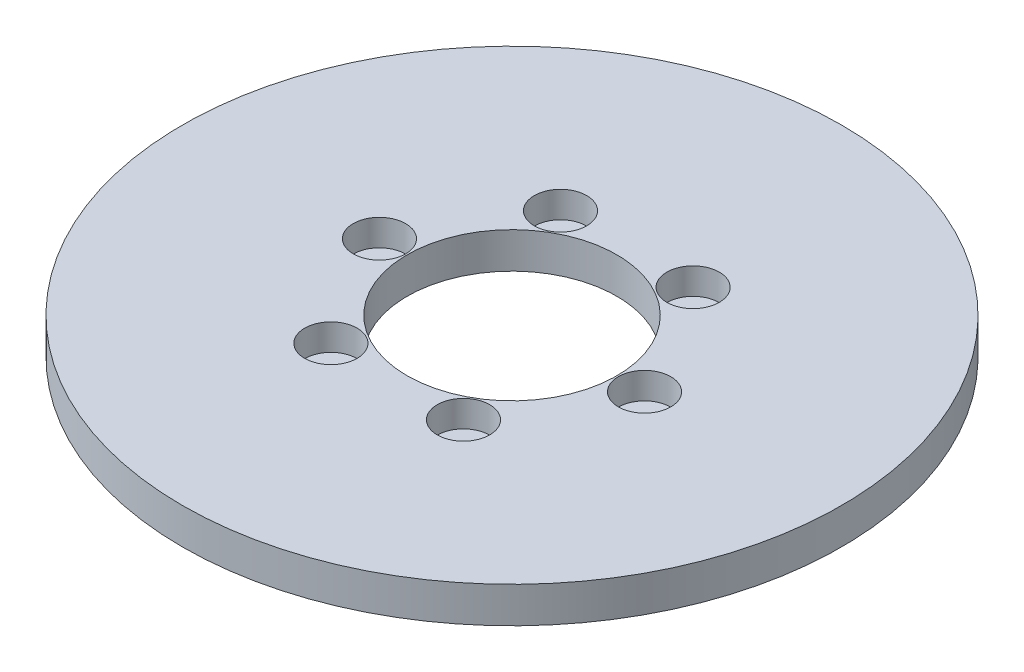
ISO-10303-21;
HEADER;
FILE_DESCRIPTION(('STEP AP214'),'2;1');
FILE_NAME('part.step','',(''),(''),'','','');
FILE_SCHEMA(('AUTOMOTIVE_DESIGN { 1 0 10303 214 1 1 1 1 }'));
ENDSEC;
DATA;
#1=APPLICATION_CONTEXT('core data for automotive mechanical design processes');
#2=APPLICATION_PROTOCOL_DEFINITION('international standard','automotive_design',2000,#1);
#3=PRODUCT_CONTEXT('',#1,'mechanical');
#4=PRODUCT('Part','Part','',(#3));
#5=PRODUCT_RELATED_PRODUCT_CATEGORY('part','',(#4));
#6=PRODUCT_DEFINITION_FORMATION('','',#4);
#7=PRODUCT_DEFINITION_CONTEXT('part definition',#1,'design');
#8=PRODUCT_DEFINITION('design','',#6,#7);
#9=PRODUCT_DEFINITION_SHAPE('','',#8);
#10=(LENGTH_UNIT() NAMED_UNIT(*) SI_UNIT(.MILLI.,.METRE.));
#11=(NAMED_UNIT(*) PLANE_ANGLE_UNIT() SI_UNIT($,.RADIAN.));
#12=(NAMED_UNIT(*) SI_UNIT($,.STERADIAN.) SOLID_ANGLE_UNIT());
#13=UNCERTAINTY_MEASURE_WITH_UNIT(LENGTH_MEASURE(1.E-05),#10,'distance_accuracy_value','');
#14=(GEOMETRIC_REPRESENTATION_CONTEXT(3) GLOBAL_UNCERTAINTY_ASSIGNED_CONTEXT((#13)) GLOBAL_UNIT_ASSIGNED_CONTEXT((#10,
#11,#12)) REPRESENTATION_CONTEXT('',''));
#15=CARTESIAN_POINT('',(0.,0.,0.));
#16=DIRECTION('',(0.,0.,1.));
#17=DIRECTION('',(1.,0.,0.));
#18=AXIS2_PLACEMENT_3D('',#15,#16,#17);
#19=CARTESIAN_POINT('',(0.,6.,0.));
#20=DIRECTION('',(0.,-1.,0.));
#21=DIRECTION('',(0.,0.,-1.));
#22=AXIS2_PLACEMENT_3D('',#19,#20,#21);
#23=CYLINDRICAL_SURFACE('',#22,55.);
#24=CARTESIAN_POINT('',(0.,6.,0.));
#25=DIRECTION('',(0.,1.,0.));
#26=DIRECTION('',(0.,0.,1.));
#27=AXIS2_PLACEMENT_3D('',#24,#25,#26);
#28=CIRCLE('',#27,55.);
#29=CARTESIAN_POINT('',(0.,6.,55.));
#30=VERTEX_POINT('',#29);
#31=EDGE_CURVE('E10',#30,#30,#28,.T.);
#32=ORIENTED_EDGE('',*,*,#31,.F.);
#33=EDGE_LOOP('',(#32));
#34=FACE_BOUND('',#33,.T.);
#35=CARTESIAN_POINT('',(0.,0.,0.));
#36=DIRECTION('',(0.,1.,0.));
#37=DIRECTION('',(0.,0.,1.));
#38=AXIS2_PLACEMENT_3D('',#35,#36,#37);
#39=CIRCLE('',#38,55.);
#40=CARTESIAN_POINT('',(0.,0.,55.));
#41=VERTEX_POINT('',#40);
#42=EDGE_CURVE('E37',#41,#41,#39,.T.);
#43=ORIENTED_EDGE('',*,*,#42,.T.);
#44=EDGE_LOOP('',(#43));
#45=FACE_BOUND('',#44,.T.);
#46=ADVANCED_FACE('F40',(#34,#45),#23,.T.);
#47=CARTESIAN_POINT('',(0.,6.,0.));
#48=DIRECTION('',(0.,1.,0.));
#49=DIRECTION('',(0.,0.,1.));
#50=AXIS2_PLACEMENT_3D('',#47,#48,#49);
#51=PLANE('',#50);
#52=CARTESIAN_POINT('',(-11.0613963231779,6.,-19.1589004343992));
#53=DIRECTION('',(0.,1.,0.));
#54=DIRECTION('',(-0.866025403784433,0.,0.50000000000001));
#55=AXIS2_PLACEMENT_3D('',#52,#53,#54);
#56=CIRCLE('',#55,4.37630442030484);
#57=CARTESIAN_POINT('',(-14.851387125856,6.,-16.9707482242467));
#58=VERTEX_POINT('',#57);
#59=EDGE_CURVE('E70',#58,#58,#56,.T.);
#60=ORIENTED_EDGE('',*,*,#59,.F.);
#61=EDGE_LOOP('',(#60));
#62=FACE_BOUND('',#61,.T.);
#63=CARTESIAN_POINT('',(11.0613963231775,6.,-19.1589004343994));
#64=DIRECTION('',(0.,1.,0.));
#65=DIRECTION('',(-0.866025403784443,0.,-0.499999999999992));
#66=AXIS2_PLACEMENT_3D('',#63,#64,#65);
#67=CIRCLE('',#66,4.37630442030484);
#68=CARTESIAN_POINT('',(7.27140552049935,6.,-21.3470526445518));
#69=VERTEX_POINT('',#68);
#70=EDGE_CURVE('E71',#69,#69,#67,.T.);
#71=ORIENTED_EDGE('',*,*,#70,.F.);
#72=EDGE_LOOP('',(#71));
#73=FACE_BOUND('',#72,.T.);
#74=CARTESIAN_POINT('',(22.1227926463553,6.,0.));
#75=DIRECTION('',(0.,1.,0.));
#76=DIRECTION('',(0.,0.,-1.));
#77=AXIS2_PLACEMENT_3D('',#74,#75,#76);
#78=CIRCLE('',#77,4.37630442030484);
#79=CARTESIAN_POINT('',(22.1227926463553,6.,-4.37630442030484));
#80=VERTEX_POINT('',#79);
#81=EDGE_CURVE('E78',#80,#80,#78,.T.);
#82=ORIENTED_EDGE('',*,*,#81,.F.);
#83=EDGE_LOOP('',(#82));
#84=FACE_BOUND('',#83,.T.);
#85=CARTESIAN_POINT('',(11.0613963231778,6.,19.1589004343992));
#86=DIRECTION('',(0.,1.,0.));
#87=DIRECTION('',(0.866025403784436,0.,-0.500000000000004));
#88=AXIS2_PLACEMENT_3D('',#85,#86,#87);
#89=CIRCLE('',#88,4.37630442030484);
#90=CARTESIAN_POINT('',(14.8513871258559,6.,16.9707482242468));
#91=VERTEX_POINT('',#90);
#92=EDGE_CURVE('E84',#91,#91,#89,.T.);
#93=ORIENTED_EDGE('',*,*,#92,.F.);
#94=EDGE_LOOP('',(#93));
#95=FACE_BOUND('',#94,.T.);
#96=CARTESIAN_POINT('',(-11.0613963231776,6.,19.1589004343993));
#97=DIRECTION('',(0.,1.,0.));
#98=DIRECTION('',(0.86602540378444,0.,0.499999999999998));
#99=AXIS2_PLACEMENT_3D('',#96,#97,#98);
#100=CIRCLE('',#99,4.37630442030484);
#101=CARTESIAN_POINT('',(-7.2714055204995,6.,21.3470526445517));
#102=VERTEX_POINT('',#101);
#103=EDGE_CURVE('E61',#102,#102,#100,.T.);
#104=ORIENTED_EDGE('',*,*,#103,.F.);
#105=EDGE_LOOP('',(#104));
#106=FACE_BOUND('',#105,.T.);
#107=CARTESIAN_POINT('',(-22.1227926463553,6.,0.));
#108=DIRECTION('',(0.,1.,0.));
#109=DIRECTION('',(0.,0.,1.));
#110=AXIS2_PLACEMENT_3D('',#107,#108,#109);
#111=CIRCLE('',#110,4.37630442030484);
#112=CARTESIAN_POINT('',(-22.1227926463553,6.,4.37630442030484));
#113=VERTEX_POINT('',#112);
#114=EDGE_CURVE('E54',#113,#113,#111,.T.);
#115=ORIENTED_EDGE('',*,*,#114,.F.);
#116=EDGE_LOOP('',(#115));
#117=FACE_BOUND('',#116,.T.);
#118=CARTESIAN_POINT('',(0.,6.,0.));
#119=DIRECTION('',(0.,1.,0.));
#120=DIRECTION('',(0.,0.,1.));
#121=AXIS2_PLACEMENT_3D('',#118,#119,#120);
#122=CIRCLE('',#121,17.5);
#123=CARTESIAN_POINT('',(0.,6.,17.5));
#124=VERTEX_POINT('',#123);
#125=EDGE_CURVE('E50',#124,#124,#122,.T.);
#126=ORIENTED_EDGE('',*,*,#125,.F.);
#127=EDGE_LOOP('',(#126));
#128=FACE_BOUND('',#127,.T.);
#129=ORIENTED_EDGE('',*,*,#31,.T.);
#130=EDGE_LOOP('',(#129));
#131=FACE_BOUND('',#130,.T.);
#132=ADVANCED_FACE('F99',(#62,#73,#84,#95,#106,#117,#128,#131),#51,.T.);
#133=CARTESIAN_POINT('',(0.,0.,0.));
#134=DIRECTION('',(0.,1.,0.));
#135=DIRECTION('',(0.,0.,1.));
#136=AXIS2_PLACEMENT_3D('',#133,#134,#135);
#137=PLANE('',#136);
#138=CARTESIAN_POINT('',(0.,0.,0.));
#139=DIRECTION('',(0.,1.,0.));
#140=DIRECTION('',(0.,0.,1.));
#141=AXIS2_PLACEMENT_3D('',#138,#139,#140);
#142=CIRCLE('',#141,17.5);
#143=CARTESIAN_POINT('',(0.,0.,17.5));
#144=VERTEX_POINT('',#143);
#145=EDGE_CURVE('E47',#144,#144,#142,.T.);
#146=ORIENTED_EDGE('',*,*,#145,.T.);
#147=EDGE_LOOP('',(#146));
#148=FACE_BOUND('',#147,.T.);
#149=ORIENTED_EDGE('',*,*,#42,.F.);
#150=EDGE_LOOP('',(#149));
#151=FACE_BOUND('',#150,.T.);
#152=ADVANCED_FACE('F103',(#148,#151),#137,.F.);
#153=CARTESIAN_POINT('',(0.,6.,0.));
#154=DIRECTION('',(0.,-1.,0.));
#155=DIRECTION('',(0.,0.,-1.));
#156=AXIS2_PLACEMENT_3D('',#153,#154,#155);
#157=CYLINDRICAL_SURFACE('',#156,17.5);
#158=ORIENTED_EDGE('',*,*,#125,.T.);
#159=EDGE_LOOP('',(#158));
#160=FACE_BOUND('',#159,.T.);
#161=ORIENTED_EDGE('',*,*,#145,.F.);
#162=EDGE_LOOP('',(#161));
#163=FACE_BOUND('',#162,.T.);
#164=ADVANCED_FACE('F115',(#160,#163),#157,.F.);
#165=CARTESIAN_POINT('',(-22.1227926463553,1.59087561665975,0.));
#166=DIRECTION('',(0.,1.,0.));
#167=DIRECTION('',(0.,0.,1.));
#168=AXIS2_PLACEMENT_3D('',#165,#166,#167);
#169=CYLINDRICAL_SURFACE('',#168,4.37630442030484);
#170=CARTESIAN_POINT('',(-22.1227926463553,1.59087561665975,0.));
#171=DIRECTION('',(0.,1.,0.));
#172=DIRECTION('',(0.,0.,1.));
#173=AXIS2_PLACEMENT_3D('',#170,#171,#172);
#174=CIRCLE('',#173,4.37630442030484);
#175=CARTESIAN_POINT('',(-22.1227926463553,1.59087561665975,4.37630442030484));
#176=VERTEX_POINT('',#175);
#177=EDGE_CURVE('E55',#176,#176,#174,.T.);
#178=ORIENTED_EDGE('',*,*,#177,.F.);
#179=EDGE_LOOP('',(#178));
#180=FACE_BOUND('',#179,.T.);
#181=ORIENTED_EDGE('',*,*,#114,.T.);
#182=EDGE_LOOP('',(#181));
#183=FACE_BOUND('',#182,.T.);
#184=ADVANCED_FACE('F113',(#180,#183),#169,.F.);
#185=CARTESIAN_POINT('',(-22.1227926463553,1.59087561665975,0.));
#186=DIRECTION('',(0.,1.,0.));
#187=DIRECTION('',(0.,0.,1.));
#188=AXIS2_PLACEMENT_3D('',#185,#186,#187);
#189=PLANE('',#188);
#190=ORIENTED_EDGE('',*,*,#177,.T.);
#191=EDGE_LOOP('',(#190));
#192=FACE_BOUND('',#191,.T.);
#193=ADVANCED_FACE('F144',(#192),#189,.T.);
#194=CARTESIAN_POINT('',(-11.0613963231776,1.59087561665975,19.1589004343993));
#195=DIRECTION('',(0.,1.,0.));
#196=DIRECTION('',(0.,0.,1.));
#197=AXIS2_PLACEMENT_3D('',#194,#195,#196);
#198=CYLINDRICAL_SURFACE('',#197,4.37630442030484);
#199=CARTESIAN_POINT('',(-11.0613963231776,1.59087561665975,19.1589004343993));
#200=DIRECTION('',(0.,1.,0.));
#201=DIRECTION('',(0.86602540378444,0.,0.499999999999998));
#202=AXIS2_PLACEMENT_3D('',#199,#200,#201);
#203=CIRCLE('',#202,4.37630442030484);
#204=CARTESIAN_POINT('',(-7.2714055204995,1.59087561665975,21.3470526445517));
#205=VERTEX_POINT('',#204);
#206=EDGE_CURVE('E59',#205,#205,#203,.T.);
#207=ORIENTED_EDGE('',*,*,#206,.F.);
#208=EDGE_LOOP('',(#207));
#209=FACE_BOUND('',#208,.T.);
#210=ORIENTED_EDGE('',*,*,#103,.T.);
#211=EDGE_LOOP('',(#210));
#212=FACE_BOUND('',#211,.T.);
#213=ADVANCED_FACE('F153',(#209,#212),#198,.F.);
#214=CARTESIAN_POINT('',(-11.0613963231776,1.59087561665975,19.1589004343993));
#215=DIRECTION('',(0.,1.,0.));
#216=DIRECTION('',(0.86602540378444,0.,0.499999999999998));
#217=AXIS2_PLACEMENT_3D('',#214,#215,#216);
#218=PLANE('',#217);
#219=ORIENTED_EDGE('',*,*,#206,.T.);
#220=EDGE_LOOP('',(#219));
#221=FACE_BOUND('',#220,.T.);
#222=ADVANCED_FACE('F96',(#221),#218,.T.);
#223=CARTESIAN_POINT('',(11.0613963231778,1.59087561665975,19.1589004343992));
#224=DIRECTION('',(0.,1.,0.));
#225=DIRECTION('',(0.,0.,1.));
#226=AXIS2_PLACEMENT_3D('',#223,#224,#225);
#227=CYLINDRICAL_SURFACE('',#226,4.37630442030484);
#228=CARTESIAN_POINT('',(11.0613963231778,1.59087561665975,19.1589004343992));
#229=DIRECTION('',(0.,1.,0.));
#230=DIRECTION('',(0.866025403784436,0.,-0.500000000000004));
#231=AXIS2_PLACEMENT_3D('',#228,#229,#230);
#232=CIRCLE('',#231,4.37630442030484);
#233=CARTESIAN_POINT('',(14.8513871258559,1.59087561665975,16.9707482242468));
#234=VERTEX_POINT('',#233);
#235=EDGE_CURVE('E63',#234,#234,#232,.T.);
#236=ORIENTED_EDGE('',*,*,#235,.F.);
#237=EDGE_LOOP('',(#236));
#238=FACE_BOUND('',#237,.T.);
#239=ORIENTED_EDGE('',*,*,#92,.T.);
#240=EDGE_LOOP('',(#239));
#241=FACE_BOUND('',#240,.T.);
#242=ADVANCED_FACE('F91',(#238,#241),#227,.F.);
#243=CARTESIAN_POINT('',(11.0613963231778,1.59087561665975,19.1589004343992));
#244=DIRECTION('',(0.,1.,0.));
#245=DIRECTION('',(0.866025403784436,0.,-0.500000000000004));
#246=AXIS2_PLACEMENT_3D('',#243,#244,#245);
#247=PLANE('',#246);
#248=ORIENTED_EDGE('',*,*,#235,.T.);
#249=EDGE_LOOP('',(#248));
#250=FACE_BOUND('',#249,.T.);
#251=ADVANCED_FACE('F93',(#250),#247,.T.);
#252=CARTESIAN_POINT('',(22.1227926463553,1.59087561665975,0.));
#253=DIRECTION('',(0.,1.,0.));
#254=DIRECTION('',(0.,0.,1.));
#255=AXIS2_PLACEMENT_3D('',#252,#253,#254);
#256=CYLINDRICAL_SURFACE('',#255,4.37630442030484);
#257=CARTESIAN_POINT('',(22.1227926463553,1.59087561665975,0.));
#258=DIRECTION('',(0.,1.,0.));
#259=DIRECTION('',(0.,0.,-1.));
#260=AXIS2_PLACEMENT_3D('',#257,#258,#259);
#261=CIRCLE('',#260,4.37630442030484);
#262=CARTESIAN_POINT('',(22.1227926463553,1.59087561665975,-4.37630442030484));
#263=VERTEX_POINT('',#262);
#264=EDGE_CURVE('E85',#263,#263,#261,.T.);
#265=ORIENTED_EDGE('',*,*,#264,.F.);
#266=EDGE_LOOP('',(#265));
#267=FACE_BOUND('',#266,.T.);
#268=ORIENTED_EDGE('',*,*,#81,.T.);
#269=EDGE_LOOP('',(#268));
#270=FACE_BOUND('',#269,.T.);
#271=ADVANCED_FACE('F187',(#267,#270),#256,.F.);
#272=CARTESIAN_POINT('',(22.1227926463553,1.59087561665975,0.));
#273=DIRECTION('',(0.,1.,0.));
#274=DIRECTION('',(0.,0.,-1.));
#275=AXIS2_PLACEMENT_3D('',#272,#273,#274);
#276=PLANE('',#275);
#277=ORIENTED_EDGE('',*,*,#264,.T.);
#278=EDGE_LOOP('',(#277));
#279=FACE_BOUND('',#278,.T.);
#280=ADVANCED_FACE('F198',(#279),#276,.T.);
#281=CARTESIAN_POINT('',(11.0613963231775,1.59087561665975,-19.1589004343994));
#282=DIRECTION('',(0.,1.,0.));
#283=DIRECTION('',(0.,0.,1.));
#284=AXIS2_PLACEMENT_3D('',#281,#282,#283);
#285=CYLINDRICAL_SURFACE('',#284,4.37630442030484);
#286=CARTESIAN_POINT('',(11.0613963231775,1.59087561665975,-19.1589004343994));
#287=DIRECTION('',(0.,1.,0.));
#288=DIRECTION('',(-0.866025403784443,0.,-0.499999999999992));
#289=AXIS2_PLACEMENT_3D('',#286,#287,#288);
#290=CIRCLE('',#289,4.37630442030484);
#291=CARTESIAN_POINT('',(7.27140552049935,1.59087561665975,-21.3470526445518));
#292=VERTEX_POINT('',#291);
#293=EDGE_CURVE('E76',#292,#292,#290,.T.);
#294=ORIENTED_EDGE('',*,*,#293,.F.);
#295=EDGE_LOOP('',(#294));
#296=FACE_BOUND('',#295,.T.);
#297=ORIENTED_EDGE('',*,*,#70,.T.);
#298=EDGE_LOOP('',(#297));
#299=FACE_BOUND('',#298,.T.);
#300=ADVANCED_FACE('F202',(#296,#299),#285,.F.);
#301=CARTESIAN_POINT('',(11.0613963231775,1.59087561665975,-19.1589004343994));
#302=DIRECTION('',(0.,1.,0.));
#303=DIRECTION('',(-0.866025403784443,0.,-0.499999999999992));
#304=AXIS2_PLACEMENT_3D('',#301,#302,#303);
#305=PLANE('',#304);
#306=ORIENTED_EDGE('',*,*,#293,.T.);
#307=EDGE_LOOP('',(#306));
#308=FACE_BOUND('',#307,.T.);
#309=ADVANCED_FACE('F212',(#308),#305,.T.);
#310=CARTESIAN_POINT('',(-11.0613963231779,1.59087561665975,-19.1589004343992));
#311=DIRECTION('',(0.,1.,0.));
#312=DIRECTION('',(0.,0.,1.));
#313=AXIS2_PLACEMENT_3D('',#310,#311,#312);
#314=CYLINDRICAL_SURFACE('',#313,4.37630442030484);
#315=CARTESIAN_POINT('',(-11.0613963231779,1.59087561665975,-19.1589004343992));
#316=DIRECTION('',(0.,1.,0.));
#317=DIRECTION('',(-0.866025403784433,0.,0.50000000000001));
#318=AXIS2_PLACEMENT_3D('',#315,#316,#317);
#319=CIRCLE('',#318,4.37630442030484);
#320=CARTESIAN_POINT('',(-14.851387125856,1.59087561665975,-16.9707482242467));
#321=VERTEX_POINT('',#320);
#322=EDGE_CURVE('E69',#321,#321,#319,.T.);
#323=ORIENTED_EDGE('',*,*,#322,.F.);
#324=EDGE_LOOP('',(#323));
#325=FACE_BOUND('',#324,.T.);
#326=ORIENTED_EDGE('',*,*,#59,.T.);
#327=EDGE_LOOP('',(#326));
#328=FACE_BOUND('',#327,.T.);
#329=ADVANCED_FACE('F224',(#325,#328),#314,.F.);
#330=CARTESIAN_POINT('',(-11.0613963231779,1.59087561665975,-19.1589004343992));
#331=DIRECTION('',(0.,1.,0.));
#332=DIRECTION('',(-0.866025403784433,0.,0.50000000000001));
#333=AXIS2_PLACEMENT_3D('',#330,#331,#332);
#334=PLANE('',#333);
#335=ORIENTED_EDGE('',*,*,#322,.T.);
#336=EDGE_LOOP('',(#335));
#337=FACE_BOUND('',#336,.T.);
#338=ADVANCED_FACE('F235',(#337),#334,.T.);
#339=CLOSED_SHELL('',(#46,#132,#152,#164,#184,#193,#213,#222,#242,#251,#271,#280,#300,#309,#329,#338));
#340=MANIFOLD_SOLID_BREP('B2',#339);
#341=ADVANCED_BREP_SHAPE_REPRESENTATION('',(#18,#340),#14);
#342=SHAPE_DEFINITION_REPRESENTATION(#9,#341);
ENDSEC;
END-ISO-10303-21;
